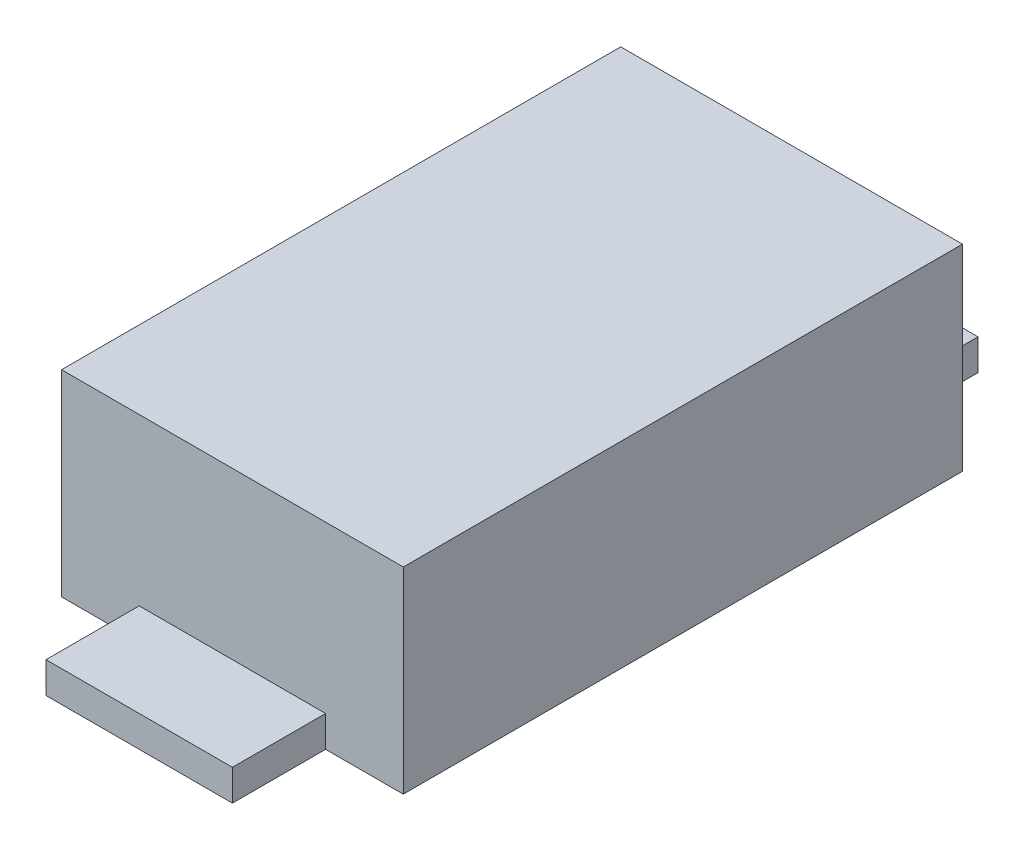
ISO-10303-21;
HEADER;
FILE_DESCRIPTION(('STEP AP214'),'2;1');
FILE_NAME('part.step','',(''),(''),'','','');
FILE_SCHEMA(('AUTOMOTIVE_DESIGN { 1 0 10303 214 1 1 1 1 }'));
ENDSEC;
DATA;
#1=APPLICATION_CONTEXT('core data for automotive mechanical design processes');
#2=APPLICATION_PROTOCOL_DEFINITION('international standard','automotive_design',2000,#1);
#3=PRODUCT_CONTEXT('',#1,'mechanical');
#4=PRODUCT('Part','Part','',(#3));
#5=PRODUCT_RELATED_PRODUCT_CATEGORY('part','',(#4));
#6=PRODUCT_DEFINITION_FORMATION('','',#4);
#7=PRODUCT_DEFINITION_CONTEXT('part definition',#1,'design');
#8=PRODUCT_DEFINITION('design','',#6,#7);
#9=PRODUCT_DEFINITION_SHAPE('','',#8);
#10=(LENGTH_UNIT() NAMED_UNIT(*) SI_UNIT(.MILLI.,.METRE.));
#11=(NAMED_UNIT(*) PLANE_ANGLE_UNIT() SI_UNIT($,.RADIAN.));
#12=(NAMED_UNIT(*) SI_UNIT($,.STERADIAN.) SOLID_ANGLE_UNIT());
#13=UNCERTAINTY_MEASURE_WITH_UNIT(LENGTH_MEASURE(1.E-05),#10,'distance_accuracy_value','');
#14=(GEOMETRIC_REPRESENTATION_CONTEXT(3) GLOBAL_UNCERTAINTY_ASSIGNED_CONTEXT((#13)) GLOBAL_UNIT_ASSIGNED_CONTEXT((#10,
#11,#12)) REPRESENTATION_CONTEXT('',''));
#15=CARTESIAN_POINT('',(0.,0.,0.));
#16=DIRECTION('',(0.,0.,1.));
#17=DIRECTION('',(1.,0.,0.));
#18=AXIS2_PLACEMENT_3D('',#15,#16,#17);
#19=CARTESIAN_POINT('',(-0.825,0.95,1.35));
#20=DIRECTION('',(0.,0.,-1.));
#21=DIRECTION('',(-1.,0.,0.));
#22=AXIS2_PLACEMENT_3D('',#19,#20,#21);
#23=PLANE('',#22);
#24=DIRECTION('',(0.,-1.,0.));
#25=VECTOR('',#24,1.);
#26=CARTESIAN_POINT('',(-0.45,0.15,1.35));
#27=LINE('',#26,#25);
#28=CARTESIAN_POINT('',(-0.45,0.15,1.35));
#29=VERTEX_POINT('',#28);
#30=CARTESIAN_POINT('',(-0.45,0.,1.35));
#31=VERTEX_POINT('',#30);
#32=EDGE_CURVE('E153',#29,#31,#27,.T.);
#33=ORIENTED_EDGE('',*,*,#32,.F.);
#34=DIRECTION('',(1.,0.,0.));
#35=VECTOR('',#34,1.);
#36=CARTESIAN_POINT('',(-0.45,0.15,1.35));
#37=LINE('',#36,#35);
#38=CARTESIAN_POINT('',(0.45,0.15,1.35));
#39=VERTEX_POINT('',#38);
#40=EDGE_CURVE('E144',#29,#39,#37,.T.);
#41=ORIENTED_EDGE('',*,*,#40,.T.);
#42=DIRECTION('',(0.,-1.,0.));
#43=VECTOR('',#42,1.);
#44=CARTESIAN_POINT('',(0.45,0.15,1.35));
#45=LINE('',#44,#43);
#46=CARTESIAN_POINT('',(0.45,0.,1.35));
#47=VERTEX_POINT('',#46);
#48=EDGE_CURVE('E159',#39,#47,#45,.T.);
#49=ORIENTED_EDGE('',*,*,#48,.T.);
#50=DIRECTION('',(1.,0.,0.));
#51=VECTOR('',#50,1.);
#52=CARTESIAN_POINT('',(-0.825,0.,1.35));
#53=LINE('',#52,#51);
#54=CARTESIAN_POINT('',(0.825,0.,1.35));
#55=VERTEX_POINT('',#54);
#56=EDGE_CURVE('E204',#47,#55,#53,.T.);
#57=ORIENTED_EDGE('',*,*,#56,.T.);
#58=DIRECTION('',(0.,-1.,0.));
#59=VECTOR('',#58,1.);
#60=CARTESIAN_POINT('',(0.825,0.95,1.35));
#61=LINE('',#60,#59);
#62=CARTESIAN_POINT('',(0.825,0.95,1.35));
#63=VERTEX_POINT('',#62);
#64=EDGE_CURVE('E195',#63,#55,#61,.T.);
#65=ORIENTED_EDGE('',*,*,#64,.F.);
#66=DIRECTION('',(1.,0.,0.));
#67=VECTOR('',#66,1.);
#68=CARTESIAN_POINT('',(-0.825,0.95,1.35));
#69=LINE('',#68,#67);
#70=CARTESIAN_POINT('',(-0.825,0.95,1.35));
#71=VERTEX_POINT('',#70);
#72=EDGE_CURVE('E193',#71,#63,#69,.T.);
#73=ORIENTED_EDGE('',*,*,#72,.F.);
#74=DIRECTION('',(0.,-1.,0.));
#75=VECTOR('',#74,1.);
#76=CARTESIAN_POINT('',(-0.825,0.95,1.35));
#77=LINE('',#76,#75);
#78=CARTESIAN_POINT('',(-0.825,0.,1.35));
#79=VERTEX_POINT('',#78);
#80=EDGE_CURVE('E209',#71,#79,#77,.T.);
#81=ORIENTED_EDGE('',*,*,#80,.T.);
#82=EDGE_CURVE('E189',#79,#31,#53,.T.);
#83=ORIENTED_EDGE('',*,*,#82,.T.);
#84=EDGE_LOOP('',(#33,#41,#49,#57,#65,#73,#81,#83));
#85=FACE_BOUND('',#84,.T.);
#86=ADVANCED_FACE('F34',(#85),#23,.F.);
#87=CARTESIAN_POINT('',(-0.825000000000001,0.95,-1.35));
#88=DIRECTION('',(0.,0.,1.));
#89=DIRECTION('',(1.,0.,0.));
#90=AXIS2_PLACEMENT_3D('',#87,#88,#89);
#91=PLANE('',#90);
#92=DIRECTION('',(0.,-1.,0.));
#93=VECTOR('',#92,1.);
#94=CARTESIAN_POINT('',(0.45,0.15,-1.35));
#95=LINE('',#94,#93);
#96=CARTESIAN_POINT('',(0.45,0.15,-1.35));
#97=VERTEX_POINT('',#96);
#98=CARTESIAN_POINT('',(0.45,0.,-1.35));
#99=VERTEX_POINT('',#98);
#100=EDGE_CURVE('E180',#97,#99,#95,.T.);
#101=ORIENTED_EDGE('',*,*,#100,.F.);
#102=DIRECTION('',(1.,0.,0.));
#103=VECTOR('',#102,1.);
#104=CARTESIAN_POINT('',(-0.45,0.15,-1.35));
#105=LINE('',#104,#103);
#106=CARTESIAN_POINT('',(-0.45,0.15,-1.35));
#107=VERTEX_POINT('',#106);
#108=EDGE_CURVE('E164',#107,#97,#105,.T.);
#109=ORIENTED_EDGE('',*,*,#108,.F.);
#110=DIRECTION('',(0.,-1.,0.));
#111=VECTOR('',#110,1.);
#112=CARTESIAN_POINT('',(-0.45,0.15,-1.35));
#113=LINE('',#112,#111);
#114=CARTESIAN_POINT('',(-0.45,0.,-1.35));
#115=VERTEX_POINT('',#114);
#116=EDGE_CURVE('E182',#107,#115,#113,.T.);
#117=ORIENTED_EDGE('',*,*,#116,.T.);
#118=DIRECTION('',(-1.,0.,0.));
#119=VECTOR('',#118,1.);
#120=CARTESIAN_POINT('',(-0.825000000000001,0.,-1.35));
#121=LINE('',#120,#119);
#122=CARTESIAN_POINT('',(-0.825000000000001,0.,-1.35));
#123=VERTEX_POINT('',#122);
#124=EDGE_CURVE('E198',#115,#123,#121,.T.);
#125=ORIENTED_EDGE('',*,*,#124,.T.);
#126=DIRECTION('',(0.,-1.,0.));
#127=VECTOR('',#126,1.);
#128=CARTESIAN_POINT('',(-0.825000000000001,0.95,-1.35));
#129=LINE('',#128,#127);
#130=CARTESIAN_POINT('',(-0.825000000000001,0.95,-1.35));
#131=VERTEX_POINT('',#130);
#132=EDGE_CURVE('E42',#131,#123,#129,.T.);
#133=ORIENTED_EDGE('',*,*,#132,.F.);
#134=DIRECTION('',(-1.,0.,0.));
#135=VECTOR('',#134,1.);
#136=CARTESIAN_POINT('',(-0.825000000000001,0.95,-1.35));
#137=LINE('',#136,#135);
#138=CARTESIAN_POINT('',(0.824999999999999,0.95,-1.35));
#139=VERTEX_POINT('',#138);
#140=EDGE_CURVE('E188',#139,#131,#137,.T.);
#141=ORIENTED_EDGE('',*,*,#140,.F.);
#142=DIRECTION('',(0.,-1.,0.));
#143=VECTOR('',#142,1.);
#144=CARTESIAN_POINT('',(0.824999999999999,0.95,-1.35));
#145=LINE('',#144,#143);
#146=CARTESIAN_POINT('',(0.824999999999999,0.,-1.35));
#147=VERTEX_POINT('',#146);
#148=EDGE_CURVE('E11',#139,#147,#145,.T.);
#149=ORIENTED_EDGE('',*,*,#148,.T.);
#150=EDGE_CURVE('E199',#147,#99,#121,.T.);
#151=ORIENTED_EDGE('',*,*,#150,.T.);
#152=EDGE_LOOP('',(#101,#109,#117,#125,#133,#141,#149,#151));
#153=FACE_BOUND('',#152,.T.);
#154=ADVANCED_FACE('F232',(#153),#91,.F.);
#155=CARTESIAN_POINT('',(0.824999999999999,0.95,-1.35));
#156=DIRECTION('',(-1.,0.,0.));
#157=DIRECTION('',(0.,0.,1.));
#158=AXIS2_PLACEMENT_3D('',#155,#156,#157);
#159=PLANE('',#158);
#160=DIRECTION('',(0.,0.,-1.));
#161=VECTOR('',#160,1.);
#162=CARTESIAN_POINT('',(0.824999999999999,0.,-1.35));
#163=LINE('',#162,#161);
#164=EDGE_CURVE('E184',#55,#147,#163,.T.);
#165=ORIENTED_EDGE('',*,*,#164,.T.);
#166=ORIENTED_EDGE('',*,*,#148,.F.);
#167=DIRECTION('',(0.,0.,-1.));
#168=VECTOR('',#167,1.);
#169=CARTESIAN_POINT('',(0.824999999999999,0.95,-1.35));
#170=LINE('',#169,#168);
#171=EDGE_CURVE('E185',#63,#139,#170,.T.);
#172=ORIENTED_EDGE('',*,*,#171,.F.);
#173=ORIENTED_EDGE('',*,*,#64,.T.);
#174=EDGE_LOOP('',(#165,#166,#172,#173));
#175=FACE_BOUND('',#174,.T.);
#176=ADVANCED_FACE('F36',(#175),#159,.F.);
#177=CARTESIAN_POINT('',(-0.825000000000001,0.95,-1.35));
#178=DIRECTION('',(1.,0.,0.));
#179=DIRECTION('',(0.,0.,-1.));
#180=AXIS2_PLACEMENT_3D('',#177,#178,#179);
#181=PLANE('',#180);
#182=DIRECTION('',(0.,0.,1.));
#183=VECTOR('',#182,1.);
#184=CARTESIAN_POINT('',(-0.825000000000001,0.,-1.35));
#185=LINE('',#184,#183);
#186=EDGE_CURVE('E202',#123,#79,#185,.T.);
#187=ORIENTED_EDGE('',*,*,#186,.T.);
#188=ORIENTED_EDGE('',*,*,#80,.F.);
#189=DIRECTION('',(0.,0.,1.));
#190=VECTOR('',#189,1.);
#191=CARTESIAN_POINT('',(-0.825000000000001,0.95,-1.35));
#192=LINE('',#191,#190);
#193=EDGE_CURVE('E191',#131,#71,#192,.T.);
#194=ORIENTED_EDGE('',*,*,#193,.F.);
#195=ORIENTED_EDGE('',*,*,#132,.T.);
#196=EDGE_LOOP('',(#187,#188,#194,#195));
#197=FACE_BOUND('',#196,.T.);
#198=ADVANCED_FACE('F216',(#197),#181,.F.);
#199=CARTESIAN_POINT('',(0.,0.95,0.));
#200=DIRECTION('',(0.,1.,0.));
#201=DIRECTION('',(0.,0.,1.));
#202=AXIS2_PLACEMENT_3D('',#199,#200,#201);
#203=PLANE('',#202);
#204=ORIENTED_EDGE('',*,*,#171,.T.);
#205=ORIENTED_EDGE('',*,*,#140,.T.);
#206=ORIENTED_EDGE('',*,*,#193,.T.);
#207=ORIENTED_EDGE('',*,*,#72,.T.);
#208=EDGE_LOOP('',(#204,#205,#206,#207));
#209=FACE_BOUND('',#208,.T.);
#210=ADVANCED_FACE('F229',(#209),#203,.T.);
#211=CARTESIAN_POINT('',(0.,0.,0.));
#212=DIRECTION('',(0.,1.,0.));
#213=DIRECTION('',(0.,0.,1.));
#214=AXIS2_PLACEMENT_3D('',#211,#212,#213);
#215=PLANE('',#214);
#216=ORIENTED_EDGE('',*,*,#164,.F.);
#217=ORIENTED_EDGE('',*,*,#56,.F.);
#218=DIRECTION('',(0.,0.,1.));
#219=VECTOR('',#218,1.);
#220=CARTESIAN_POINT('',(0.45,0.,1.35));
#221=LINE('',#220,#219);
#222=CARTESIAN_POINT('',(0.45,0.,1.8));
#223=VERTEX_POINT('',#222);
#224=EDGE_CURVE('E49',#47,#223,#221,.T.);
#225=ORIENTED_EDGE('',*,*,#224,.T.);
#226=DIRECTION('',(-1.,0.,0.));
#227=VECTOR('',#226,1.);
#228=CARTESIAN_POINT('',(-0.45,0.,1.8));
#229=LINE('',#228,#227);
#230=CARTESIAN_POINT('',(-0.45,0.,1.8));
#231=VERTEX_POINT('',#230);
#232=EDGE_CURVE('E155',#223,#231,#229,.T.);
#233=ORIENTED_EDGE('',*,*,#232,.T.);
#234=DIRECTION('',(0.,0.,-1.));
#235=VECTOR('',#234,1.);
#236=CARTESIAN_POINT('',(-0.45,0.,1.35));
#237=LINE('',#236,#235);
#238=EDGE_CURVE('E130',#231,#31,#237,.T.);
#239=ORIENTED_EDGE('',*,*,#238,.T.);
#240=ORIENTED_EDGE('',*,*,#82,.F.);
#241=ORIENTED_EDGE('',*,*,#186,.F.);
#242=ORIENTED_EDGE('',*,*,#124,.F.);
#243=DIRECTION('',(0.,0.,1.));
#244=VECTOR('',#243,1.);
#245=CARTESIAN_POINT('',(-0.45,0.,-1.35));
#246=LINE('',#245,#244);
#247=CARTESIAN_POINT('',(-0.45,0.,-1.8));
#248=VERTEX_POINT('',#247);
#249=EDGE_CURVE('E57',#248,#115,#246,.T.);
#250=ORIENTED_EDGE('',*,*,#249,.F.);
#251=DIRECTION('',(-1.,0.,0.));
#252=VECTOR('',#251,1.);
#253=CARTESIAN_POINT('',(-0.45,0.,-1.8));
#254=LINE('',#253,#252);
#255=CARTESIAN_POINT('',(0.45,0.,-1.8));
#256=VERTEX_POINT('',#255);
#257=EDGE_CURVE('E165',#256,#248,#254,.T.);
#258=ORIENTED_EDGE('',*,*,#257,.F.);
#259=DIRECTION('',(0.,0.,-1.));
#260=VECTOR('',#259,1.);
#261=CARTESIAN_POINT('',(0.45,0.,-1.35));
#262=LINE('',#261,#260);
#263=EDGE_CURVE('E173',#99,#256,#262,.T.);
#264=ORIENTED_EDGE('',*,*,#263,.F.);
#265=ORIENTED_EDGE('',*,*,#150,.F.);
#266=EDGE_LOOP('',(#216,#217,#225,#233,#239,#240,#241,#242,#250,#258,#264,#265));
#267=FACE_BOUND('',#266,.T.);
#268=ADVANCED_FACE('F223',(#267),#215,.F.);
#269=CARTESIAN_POINT('',(-0.45,0.15,-1.35));
#270=DIRECTION('',(1.,0.,0.));
#271=DIRECTION('',(0.,0.,-1.));
#272=AXIS2_PLACEMENT_3D('',#269,#270,#271);
#273=PLANE('',#272);
#274=ORIENTED_EDGE('',*,*,#249,.T.);
#275=ORIENTED_EDGE('',*,*,#116,.F.);
#276=DIRECTION('',(0.,0.,1.));
#277=VECTOR('',#276,1.);
#278=CARTESIAN_POINT('',(-0.45,0.15,-1.35));
#279=LINE('',#278,#277);
#280=CARTESIAN_POINT('',(-0.45,0.15,-1.8));
#281=VERTEX_POINT('',#280);
#282=EDGE_CURVE('E162',#281,#107,#279,.T.);
#283=ORIENTED_EDGE('',*,*,#282,.F.);
#284=DIRECTION('',(0.,-1.,0.));
#285=VECTOR('',#284,1.);
#286=CARTESIAN_POINT('',(-0.45,0.15,-1.8));
#287=LINE('',#286,#285);
#288=EDGE_CURVE('E171',#281,#248,#287,.T.);
#289=ORIENTED_EDGE('',*,*,#288,.T.);
#290=EDGE_LOOP('',(#274,#275,#283,#289));
#291=FACE_BOUND('',#290,.T.);
#292=ADVANCED_FACE('F249',(#291),#273,.F.);
#293=CARTESIAN_POINT('',(0.45,0.15,-1.35));
#294=DIRECTION('',(-1.,0.,0.));
#295=DIRECTION('',(0.,0.,1.));
#296=AXIS2_PLACEMENT_3D('',#293,#294,#295);
#297=PLANE('',#296);
#298=ORIENTED_EDGE('',*,*,#263,.T.);
#299=DIRECTION('',(0.,-1.,0.));
#300=VECTOR('',#299,1.);
#301=CARTESIAN_POINT('',(0.45,0.15,-1.8));
#302=LINE('',#301,#300);
#303=CARTESIAN_POINT('',(0.45,0.15,-1.8));
#304=VERTEX_POINT('',#303);
#305=EDGE_CURVE('E177',#304,#256,#302,.T.);
#306=ORIENTED_EDGE('',*,*,#305,.F.);
#307=DIRECTION('',(0.,0.,-1.));
#308=VECTOR('',#307,1.);
#309=CARTESIAN_POINT('',(0.45,0.15,-1.35));
#310=LINE('',#309,#308);
#311=EDGE_CURVE('E167',#97,#304,#310,.T.);
#312=ORIENTED_EDGE('',*,*,#311,.F.);
#313=ORIENTED_EDGE('',*,*,#100,.T.);
#314=EDGE_LOOP('',(#298,#306,#312,#313));
#315=FACE_BOUND('',#314,.T.);
#316=ADVANCED_FACE('F239',(#315),#297,.F.);
#317=CARTESIAN_POINT('',(-0.45,0.15,-1.8));
#318=DIRECTION('',(0.,0.,1.));
#319=DIRECTION('',(1.,0.,0.));
#320=AXIS2_PLACEMENT_3D('',#317,#318,#319);
#321=PLANE('',#320);
#322=ORIENTED_EDGE('',*,*,#257,.T.);
#323=ORIENTED_EDGE('',*,*,#288,.F.);
#324=DIRECTION('',(-1.,0.,0.));
#325=VECTOR('',#324,1.);
#326=CARTESIAN_POINT('',(-0.45,0.15,-1.8));
#327=LINE('',#326,#325);
#328=EDGE_CURVE('E169',#304,#281,#327,.T.);
#329=ORIENTED_EDGE('',*,*,#328,.F.);
#330=ORIENTED_EDGE('',*,*,#305,.T.);
#331=EDGE_LOOP('',(#322,#323,#329,#330));
#332=FACE_BOUND('',#331,.T.);
#333=ADVANCED_FACE('F243',(#332),#321,.F.);
#334=CARTESIAN_POINT('',(0.,0.15,0.));
#335=DIRECTION('',(0.,-1.,0.));
#336=DIRECTION('',(0.,0.,-1.));
#337=AXIS2_PLACEMENT_3D('',#334,#335,#336);
#338=PLANE('',#337);
#339=ORIENTED_EDGE('',*,*,#282,.T.);
#340=ORIENTED_EDGE('',*,*,#108,.T.);
#341=ORIENTED_EDGE('',*,*,#311,.T.);
#342=ORIENTED_EDGE('',*,*,#328,.T.);
#343=EDGE_LOOP('',(#339,#340,#341,#342));
#344=FACE_BOUND('',#343,.T.);
#345=ADVANCED_FACE('F247',(#344),#338,.F.);
#346=CARTESIAN_POINT('',(-0.45,0.15,1.35));
#347=DIRECTION('',(-1.,0.,0.));
#348=DIRECTION('',(0.,0.,1.));
#349=AXIS2_PLACEMENT_3D('',#346,#347,#348);
#350=PLANE('',#349);
#351=ORIENTED_EDGE('',*,*,#238,.F.);
#352=DIRECTION('',(0.,-1.,0.));
#353=VECTOR('',#352,1.);
#354=CARTESIAN_POINT('',(-0.45,0.15,1.8));
#355=LINE('',#354,#353);
#356=CARTESIAN_POINT('',(-0.45,0.15,1.8));
#357=VERTEX_POINT('',#356);
#358=EDGE_CURVE('E124',#357,#231,#355,.T.);
#359=ORIENTED_EDGE('',*,*,#358,.F.);
#360=DIRECTION('',(0.,0.,-1.));
#361=VECTOR('',#360,1.);
#362=CARTESIAN_POINT('',(-0.45,0.15,1.35));
#363=LINE('',#362,#361);
#364=EDGE_CURVE('E127',#357,#29,#363,.T.);
#365=ORIENTED_EDGE('',*,*,#364,.T.);
#366=ORIENTED_EDGE('',*,*,#32,.T.);
#367=EDGE_LOOP('',(#351,#359,#365,#366));
#368=FACE_BOUND('',#367,.T.);
#369=ADVANCED_FACE('F126',(#368),#350,.T.);
#370=CARTESIAN_POINT('',(-0.45,0.15,1.8));
#371=DIRECTION('',(0.,0.,1.));
#372=DIRECTION('',(1.,0.,0.));
#373=AXIS2_PLACEMENT_3D('',#370,#371,#372);
#374=PLANE('',#373);
#375=ORIENTED_EDGE('',*,*,#232,.F.);
#376=DIRECTION('',(0.,-1.,0.));
#377=VECTOR('',#376,1.);
#378=CARTESIAN_POINT('',(0.45,0.15,1.8));
#379=LINE('',#378,#377);
#380=CARTESIAN_POINT('',(0.45,0.15,1.8));
#381=VERTEX_POINT('',#380);
#382=EDGE_CURVE('E135',#381,#223,#379,.T.);
#383=ORIENTED_EDGE('',*,*,#382,.F.);
#384=DIRECTION('',(-1.,0.,0.));
#385=VECTOR('',#384,1.);
#386=CARTESIAN_POINT('',(-0.45,0.15,1.8));
#387=LINE('',#386,#385);
#388=EDGE_CURVE('E141',#381,#357,#387,.T.);
#389=ORIENTED_EDGE('',*,*,#388,.T.);
#390=ORIENTED_EDGE('',*,*,#358,.T.);
#391=EDGE_LOOP('',(#375,#383,#389,#390));
#392=FACE_BOUND('',#391,.T.);
#393=ADVANCED_FACE('F147',(#392),#374,.T.);
#394=CARTESIAN_POINT('',(0.45,0.15,1.35));
#395=DIRECTION('',(1.,0.,0.));
#396=DIRECTION('',(0.,0.,-1.));
#397=AXIS2_PLACEMENT_3D('',#394,#395,#396);
#398=PLANE('',#397);
#399=ORIENTED_EDGE('',*,*,#224,.F.);
#400=ORIENTED_EDGE('',*,*,#48,.F.);
#401=DIRECTION('',(0.,0.,1.));
#402=VECTOR('',#401,1.);
#403=CARTESIAN_POINT('',(0.45,0.15,1.35));
#404=LINE('',#403,#402);
#405=EDGE_CURVE('E148',#39,#381,#404,.T.);
#406=ORIENTED_EDGE('',*,*,#405,.T.);
#407=ORIENTED_EDGE('',*,*,#382,.T.);
#408=EDGE_LOOP('',(#399,#400,#406,#407));
#409=FACE_BOUND('',#408,.T.);
#410=ADVANCED_FACE('F338',(#409),#398,.T.);
#411=CARTESIAN_POINT('',(0.,0.15,0.));
#412=DIRECTION('',(0.,-1.,0.));
#413=DIRECTION('',(0.,0.,1.));
#414=AXIS2_PLACEMENT_3D('',#411,#412,#413);
#415=PLANE('',#414);
#416=ORIENTED_EDGE('',*,*,#364,.F.);
#417=ORIENTED_EDGE('',*,*,#388,.F.);
#418=ORIENTED_EDGE('',*,*,#405,.F.);
#419=ORIENTED_EDGE('',*,*,#40,.F.);
#420=EDGE_LOOP('',(#416,#417,#418,#419));
#421=FACE_BOUND('',#420,.T.);
#422=ADVANCED_FACE('F139',(#421),#415,.F.);
#423=CLOSED_SHELL('',(#86,#154,#176,#198,#210,#268,#292,#316,#333,#345,#369,#393,#410,#422));
#424=MANIFOLD_SOLID_BREP('B2',#423);
#425=ADVANCED_BREP_SHAPE_REPRESENTATION('',(#18,#424),#14);
#426=SHAPE_DEFINITION_REPRESENTATION(#9,#425);
ENDSEC;
END-ISO-10303-21;
